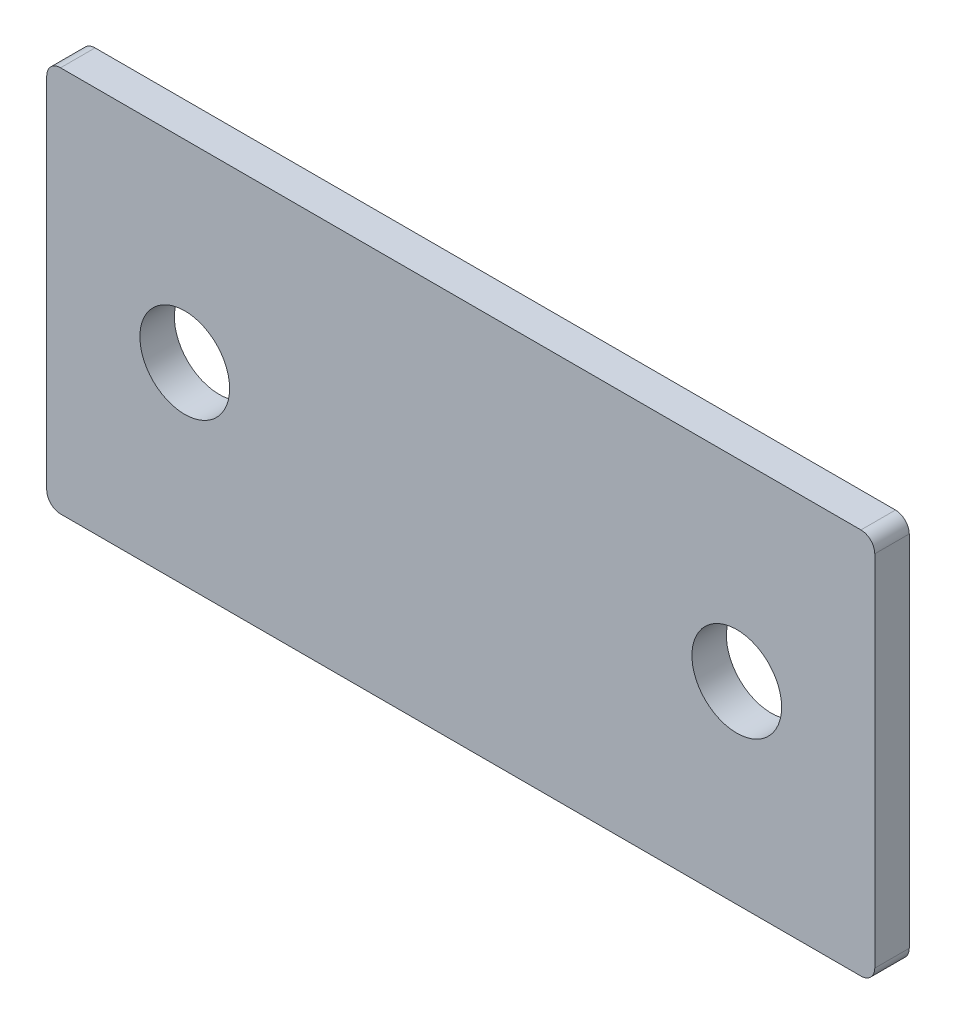
ISO-10303-21;
HEADER;
FILE_DESCRIPTION(('STEP AP214'),'2;1');
FILE_NAME('part.step','',(''),(''),'','','');
FILE_SCHEMA(('AUTOMOTIVE_DESIGN { 1 0 10303 214 1 1 1 1 }'));
ENDSEC;
DATA;
#1=APPLICATION_CONTEXT('core data for automotive mechanical design processes');
#2=APPLICATION_PROTOCOL_DEFINITION('international standard','automotive_design',2000,#1);
#3=PRODUCT_CONTEXT('',#1,'mechanical');
#4=PRODUCT('Part','Part','',(#3));
#5=PRODUCT_RELATED_PRODUCT_CATEGORY('part','',(#4));
#6=PRODUCT_DEFINITION_FORMATION('','',#4);
#7=PRODUCT_DEFINITION_CONTEXT('part definition',#1,'design');
#8=PRODUCT_DEFINITION('design','',#6,#7);
#9=PRODUCT_DEFINITION_SHAPE('','',#8);
#10=(LENGTH_UNIT() NAMED_UNIT(*) SI_UNIT(.MILLI.,.METRE.));
#11=(NAMED_UNIT(*) PLANE_ANGLE_UNIT() SI_UNIT($,.RADIAN.));
#12=(NAMED_UNIT(*) SI_UNIT($,.STERADIAN.) SOLID_ANGLE_UNIT());
#13=UNCERTAINTY_MEASURE_WITH_UNIT(LENGTH_MEASURE(1.E-05),#10,'distance_accuracy_value','');
#14=(GEOMETRIC_REPRESENTATION_CONTEXT(3) GLOBAL_UNCERTAINTY_ASSIGNED_CONTEXT((#13)) GLOBAL_UNIT_ASSIGNED_CONTEXT((#10,
#11,#12)) REPRESENTATION_CONTEXT('',''));
#15=CARTESIAN_POINT('',(0.,0.,0.));
#16=DIRECTION('',(0.,0.,1.));
#17=DIRECTION('',(1.,0.,0.));
#18=AXIS2_PLACEMENT_3D('',#15,#16,#17);
#19=CARTESIAN_POINT('',(0.,0.,2.5));
#20=DIRECTION('',(0.,0.,-1.));
#21=DIRECTION('',(-1.,0.,0.));
#22=AXIS2_PLACEMENT_3D('',#19,#20,#21);
#23=PLANE('',#22);
#24=DIRECTION('',(0.,-1.,0.));
#25=VECTOR('',#24,1.);
#26=CARTESIAN_POINT('',(-30.,-14.,2.5));
#27=LINE('',#26,#25);
#28=CARTESIAN_POINT('',(-30.,13.,2.5));
#29=VERTEX_POINT('',#28);
#30=CARTESIAN_POINT('',(-30.,-13.,2.5));
#31=VERTEX_POINT('',#30);
#32=EDGE_CURVE('E173',#29,#31,#27,.T.);
#33=ORIENTED_EDGE('',*,*,#32,.T.);
#34=CARTESIAN_POINT('',(-29.,-13.,2.5));
#35=DIRECTION('',(0.,0.,-1.));
#36=DIRECTION('',(-1.,0.,0.));
#37=AXIS2_PLACEMENT_3D('',#34,#35,#36);
#38=CIRCLE('',#37,1.);
#39=CARTESIAN_POINT('',(-29.,-14.,2.5));
#40=VERTEX_POINT('',#39);
#41=EDGE_CURVE('E150',#31,#40,#38,.F.);
#42=ORIENTED_EDGE('',*,*,#41,.T.);
#43=DIRECTION('',(1.,0.,0.));
#44=VECTOR('',#43,1.);
#45=CARTESIAN_POINT('',(-30.,-14.,2.5));
#46=LINE('',#45,#44);
#47=CARTESIAN_POINT('',(29.,-14.,2.5));
#48=VERTEX_POINT('',#47);
#49=EDGE_CURVE('E121',#40,#48,#46,.T.);
#50=ORIENTED_EDGE('',*,*,#49,.T.);
#51=CARTESIAN_POINT('',(29.,-13.,2.5));
#52=DIRECTION('',(0.,0.,-1.));
#53=DIRECTION('',(-1.,0.,0.));
#54=AXIS2_PLACEMENT_3D('',#51,#52,#53);
#55=CIRCLE('',#54,1.);
#56=CARTESIAN_POINT('',(30.,-13.,2.5));
#57=VERTEX_POINT('',#56);
#58=EDGE_CURVE('E146',#48,#57,#55,.F.);
#59=ORIENTED_EDGE('',*,*,#58,.T.);
#60=DIRECTION('',(0.,1.,0.));
#61=VECTOR('',#60,1.);
#62=CARTESIAN_POINT('',(30.,-14.,2.5));
#63=LINE('',#62,#61);
#64=CARTESIAN_POINT('',(30.,13.,2.5));
#65=VERTEX_POINT('',#64);
#66=EDGE_CURVE('E129',#57,#65,#63,.T.);
#67=ORIENTED_EDGE('',*,*,#66,.T.);
#68=CARTESIAN_POINT('',(29.,13.,2.5));
#69=DIRECTION('',(0.,0.,-1.));
#70=DIRECTION('',(-1.,0.,0.));
#71=AXIS2_PLACEMENT_3D('',#68,#69,#70);
#72=CIRCLE('',#71,1.);
#73=CARTESIAN_POINT('',(29.,14.,2.5));
#74=VERTEX_POINT('',#73);
#75=EDGE_CURVE('E56',#65,#74,#72,.F.);
#76=ORIENTED_EDGE('',*,*,#75,.T.);
#77=DIRECTION('',(-1.,0.,0.));
#78=VECTOR('',#77,1.);
#79=CARTESIAN_POINT('',(-30.,14.,2.5));
#80=LINE('',#79,#78);
#81=CARTESIAN_POINT('',(-29.,14.,2.5));
#82=VERTEX_POINT('',#81);
#83=EDGE_CURVE('E132',#74,#82,#80,.T.);
#84=ORIENTED_EDGE('',*,*,#83,.T.);
#85=CARTESIAN_POINT('',(-29.,13.,2.5));
#86=DIRECTION('',(0.,0.,-1.));
#87=DIRECTION('',(-1.,0.,0.));
#88=AXIS2_PLACEMENT_3D('',#85,#86,#87);
#89=CIRCLE('',#88,1.);
#90=EDGE_CURVE('E148',#82,#29,#89,.F.);
#91=ORIENTED_EDGE('',*,*,#90,.T.);
#92=EDGE_LOOP('',(#33,#42,#50,#59,#67,#76,#84,#91));
#93=FACE_BOUND('',#92,.T.);
#94=CARTESIAN_POINT('',(-20.,0.,2.5));
#95=DIRECTION('',(0.,0.,1.));
#96=DIRECTION('',(1.,0.,0.));
#97=AXIS2_PLACEMENT_3D('',#94,#95,#96);
#98=CIRCLE('',#97,3.25);
#99=CARTESIAN_POINT('',(-16.75,0.,2.5));
#100=VERTEX_POINT('',#99);
#101=EDGE_CURVE('E169',#100,#100,#98,.T.);
#102=ORIENTED_EDGE('',*,*,#101,.F.);
#103=EDGE_LOOP('',(#102));
#104=FACE_BOUND('',#103,.T.);
#105=CARTESIAN_POINT('',(20.,0.,2.5));
#106=DIRECTION('',(0.,0.,1.));
#107=DIRECTION('',(1.,0.,0.));
#108=AXIS2_PLACEMENT_3D('',#105,#106,#107);
#109=CIRCLE('',#108,3.25);
#110=CARTESIAN_POINT('',(23.25,0.,2.5));
#111=VERTEX_POINT('',#110);
#112=EDGE_CURVE('E179',#111,#111,#109,.T.);
#113=ORIENTED_EDGE('',*,*,#112,.F.);
#114=EDGE_LOOP('',(#113));
#115=FACE_BOUND('',#114,.T.);
#116=ADVANCED_FACE('F34',(#93,#104,#115),#23,.F.);
#117=CARTESIAN_POINT('',(0.,0.,0.));
#118=DIRECTION('',(0.,0.,-1.));
#119=DIRECTION('',(-1.,0.,0.));
#120=AXIS2_PLACEMENT_3D('',#117,#118,#119);
#121=PLANE('',#120);
#122=CARTESIAN_POINT('',(-20.,0.,0.));
#123=DIRECTION('',(0.,0.,1.));
#124=DIRECTION('',(1.,0.,0.));
#125=AXIS2_PLACEMENT_3D('',#122,#123,#124);
#126=CIRCLE('',#125,3.25);
#127=CARTESIAN_POINT('',(-16.75,0.,0.));
#128=VERTEX_POINT('',#127);
#129=EDGE_CURVE('E176',#128,#128,#126,.T.);
#130=ORIENTED_EDGE('',*,*,#129,.T.);
#131=EDGE_LOOP('',(#130));
#132=FACE_BOUND('',#131,.T.);
#133=DIRECTION('',(1.,0.,0.));
#134=VECTOR('',#133,1.);
#135=CARTESIAN_POINT('',(-30.,-14.,0.));
#136=LINE('',#135,#134);
#137=CARTESIAN_POINT('',(-29.,-14.,0.));
#138=VERTEX_POINT('',#137);
#139=CARTESIAN_POINT('',(29.,-14.,0.));
#140=VERTEX_POINT('',#139);
#141=EDGE_CURVE('E118',#138,#140,#136,.T.);
#142=ORIENTED_EDGE('',*,*,#141,.F.);
#143=CARTESIAN_POINT('',(-29.,-13.,0.));
#144=DIRECTION('',(0.,0.,-1.));
#145=DIRECTION('',(-1.,0.,0.));
#146=AXIS2_PLACEMENT_3D('',#143,#144,#145);
#147=CIRCLE('',#146,1.);
#148=CARTESIAN_POINT('',(-30.,-13.,0.));
#149=VERTEX_POINT('',#148);
#150=EDGE_CURVE('E101',#138,#149,#147,.T.);
#151=ORIENTED_EDGE('',*,*,#150,.T.);
#152=DIRECTION('',(0.,-1.,0.));
#153=VECTOR('',#152,1.);
#154=CARTESIAN_POINT('',(-30.,-14.,0.));
#155=LINE('',#154,#153);
#156=CARTESIAN_POINT('',(-30.,13.,0.));
#157=VERTEX_POINT('',#156);
#158=EDGE_CURVE('E130',#157,#149,#155,.T.);
#159=ORIENTED_EDGE('',*,*,#158,.F.);
#160=CARTESIAN_POINT('',(-29.,13.,0.));
#161=DIRECTION('',(0.,0.,-1.));
#162=DIRECTION('',(-1.,0.,0.));
#163=AXIS2_PLACEMENT_3D('',#160,#161,#162);
#164=CIRCLE('',#163,1.);
#165=CARTESIAN_POINT('',(-29.,14.,0.));
#166=VERTEX_POINT('',#165);
#167=EDGE_CURVE('E112',#157,#166,#164,.T.);
#168=ORIENTED_EDGE('',*,*,#167,.T.);
#169=DIRECTION('',(-1.,0.,0.));
#170=VECTOR('',#169,1.);
#171=CARTESIAN_POINT('',(-30.,14.,0.));
#172=LINE('',#171,#170);
#173=CARTESIAN_POINT('',(29.,14.,0.));
#174=VERTEX_POINT('',#173);
#175=EDGE_CURVE('E134',#174,#166,#172,.T.);
#176=ORIENTED_EDGE('',*,*,#175,.F.);
#177=CARTESIAN_POINT('',(29.,13.,0.));
#178=DIRECTION('',(0.,0.,-1.));
#179=DIRECTION('',(-1.,0.,0.));
#180=AXIS2_PLACEMENT_3D('',#177,#178,#179);
#181=CIRCLE('',#180,1.);
#182=CARTESIAN_POINT('',(30.,13.,0.));
#183=VERTEX_POINT('',#182);
#184=EDGE_CURVE('E122',#174,#183,#181,.T.);
#185=ORIENTED_EDGE('',*,*,#184,.T.);
#186=DIRECTION('',(0.,1.,0.));
#187=VECTOR('',#186,1.);
#188=CARTESIAN_POINT('',(30.,-14.,0.));
#189=LINE('',#188,#187);
#190=CARTESIAN_POINT('',(30.,-13.,0.));
#191=VERTEX_POINT('',#190);
#192=EDGE_CURVE('E161',#191,#183,#189,.T.);
#193=ORIENTED_EDGE('',*,*,#192,.F.);
#194=CARTESIAN_POINT('',(29.,-13.,0.));
#195=DIRECTION('',(0.,0.,-1.));
#196=DIRECTION('',(-1.,0.,0.));
#197=AXIS2_PLACEMENT_3D('',#194,#195,#196);
#198=CIRCLE('',#197,1.);
#199=EDGE_CURVE('E128',#191,#140,#198,.T.);
#200=ORIENTED_EDGE('',*,*,#199,.T.);
#201=EDGE_LOOP('',(#142,#151,#159,#168,#176,#185,#193,#200));
#202=FACE_BOUND('',#201,.T.);
#203=CARTESIAN_POINT('',(20.,0.,0.));
#204=DIRECTION('',(0.,0.,1.));
#205=DIRECTION('',(1.,0.,0.));
#206=AXIS2_PLACEMENT_3D('',#203,#204,#205);
#207=CIRCLE('',#206,3.25);
#208=CARTESIAN_POINT('',(23.25,0.,0.));
#209=VERTEX_POINT('',#208);
#210=EDGE_CURVE('E182',#209,#209,#207,.T.);
#211=ORIENTED_EDGE('',*,*,#210,.T.);
#212=EDGE_LOOP('',(#211));
#213=FACE_BOUND('',#212,.T.);
#214=ADVANCED_FACE('F125',(#132,#202,#213),#121,.T.);
#215=CARTESIAN_POINT('',(30.,-14.,2.5));
#216=DIRECTION('',(-1.,0.,0.));
#217=DIRECTION('',(0.,0.,1.));
#218=AXIS2_PLACEMENT_3D('',#215,#216,#217);
#219=PLANE('',#218);
#220=ORIENTED_EDGE('',*,*,#66,.F.);
#221=DIRECTION('',(0.,0.,-1.));
#222=VECTOR('',#221,1.);
#223=CARTESIAN_POINT('',(30.,-13.,2.5));
#224=LINE('',#223,#222);
#225=EDGE_CURVE('E11',#57,#191,#224,.T.);
#226=ORIENTED_EDGE('',*,*,#225,.T.);
#227=ORIENTED_EDGE('',*,*,#192,.T.);
#228=DIRECTION('',(0.,0.,-1.));
#229=VECTOR('',#228,1.);
#230=CARTESIAN_POINT('',(30.,13.,2.5));
#231=LINE('',#230,#229);
#232=EDGE_CURVE('E42',#183,#65,#231,.F.);
#233=ORIENTED_EDGE('',*,*,#232,.T.);
#234=EDGE_LOOP('',(#220,#226,#227,#233));
#235=FACE_BOUND('',#234,.T.);
#236=ADVANCED_FACE('F159',(#235),#219,.F.);
#237=CARTESIAN_POINT('',(-30.,14.,2.5));
#238=DIRECTION('',(0.,-1.,0.));
#239=DIRECTION('',(0.,0.,-1.));
#240=AXIS2_PLACEMENT_3D('',#237,#238,#239);
#241=PLANE('',#240);
#242=ORIENTED_EDGE('',*,*,#175,.T.);
#243=DIRECTION('',(0.,0.,-1.));
#244=VECTOR('',#243,1.);
#245=CARTESIAN_POINT('',(-29.,14.,2.5));
#246=LINE('',#245,#244);
#247=EDGE_CURVE('E49',#166,#82,#246,.F.);
#248=ORIENTED_EDGE('',*,*,#247,.T.);
#249=ORIENTED_EDGE('',*,*,#83,.F.);
#250=DIRECTION('',(0.,0.,-1.));
#251=VECTOR('',#250,1.);
#252=CARTESIAN_POINT('',(29.,14.,2.5));
#253=LINE('',#252,#251);
#254=EDGE_CURVE('E152',#74,#174,#253,.T.);
#255=ORIENTED_EDGE('',*,*,#254,.T.);
#256=EDGE_LOOP('',(#242,#248,#249,#255));
#257=FACE_BOUND('',#256,.T.);
#258=ADVANCED_FACE('F168',(#257),#241,.F.);
#259=CARTESIAN_POINT('',(-30.,-14.,2.5));
#260=DIRECTION('',(1.,0.,0.));
#261=DIRECTION('',(0.,0.,-1.));
#262=AXIS2_PLACEMENT_3D('',#259,#260,#261);
#263=PLANE('',#262);
#264=ORIENTED_EDGE('',*,*,#158,.T.);
#265=DIRECTION('',(0.,0.,-1.));
#266=VECTOR('',#265,1.);
#267=CARTESIAN_POINT('',(-30.,-13.,2.5));
#268=LINE('',#267,#266);
#269=EDGE_CURVE('E106',#149,#31,#268,.F.);
#270=ORIENTED_EDGE('',*,*,#269,.T.);
#271=ORIENTED_EDGE('',*,*,#32,.F.);
#272=DIRECTION('',(0.,0.,-1.));
#273=VECTOR('',#272,1.);
#274=CARTESIAN_POINT('',(-30.,13.,2.5));
#275=LINE('',#274,#273);
#276=EDGE_CURVE('E111',#29,#157,#275,.T.);
#277=ORIENTED_EDGE('',*,*,#276,.T.);
#278=EDGE_LOOP('',(#264,#270,#271,#277));
#279=FACE_BOUND('',#278,.T.);
#280=ADVANCED_FACE('F204',(#279),#263,.F.);
#281=CARTESIAN_POINT('',(-30.,-14.,2.5));
#282=DIRECTION('',(0.,1.,0.));
#283=DIRECTION('',(0.,0.,1.));
#284=AXIS2_PLACEMENT_3D('',#281,#282,#283);
#285=PLANE('',#284);
#286=ORIENTED_EDGE('',*,*,#49,.F.);
#287=DIRECTION('',(0.,0.,-1.));
#288=VECTOR('',#287,1.);
#289=CARTESIAN_POINT('',(-29.,-14.,2.5));
#290=LINE('',#289,#288);
#291=EDGE_CURVE('E105',#40,#138,#290,.T.);
#292=ORIENTED_EDGE('',*,*,#291,.T.);
#293=ORIENTED_EDGE('',*,*,#141,.T.);
#294=DIRECTION('',(0.,0.,-1.));
#295=VECTOR('',#294,1.);
#296=CARTESIAN_POINT('',(29.,-14.,2.5));
#297=LINE('',#296,#295);
#298=EDGE_CURVE('E123',#140,#48,#297,.F.);
#299=ORIENTED_EDGE('',*,*,#298,.T.);
#300=EDGE_LOOP('',(#286,#292,#293,#299));
#301=FACE_BOUND('',#300,.T.);
#302=ADVANCED_FACE('F117',(#301),#285,.F.);
#303=CARTESIAN_POINT('',(-20.,0.,2.5));
#304=DIRECTION('',(0.,0.,-1.));
#305=DIRECTION('',(-1.,0.,0.));
#306=AXIS2_PLACEMENT_3D('',#303,#304,#305);
#307=CYLINDRICAL_SURFACE('',#306,3.25);
#308=ORIENTED_EDGE('',*,*,#101,.T.);
#309=EDGE_LOOP('',(#308));
#310=FACE_BOUND('',#309,.T.);
#311=ORIENTED_EDGE('',*,*,#129,.F.);
#312=EDGE_LOOP('',(#311));
#313=FACE_BOUND('',#312,.T.);
#314=ADVANCED_FACE('F199',(#310,#313),#307,.F.);
#315=CARTESIAN_POINT('',(20.,0.,2.5));
#316=DIRECTION('',(0.,0.,-1.));
#317=DIRECTION('',(-1.,0.,0.));
#318=AXIS2_PLACEMENT_3D('',#315,#316,#317);
#319=CYLINDRICAL_SURFACE('',#318,3.25);
#320=ORIENTED_EDGE('',*,*,#112,.T.);
#321=EDGE_LOOP('',(#320));
#322=FACE_BOUND('',#321,.T.);
#323=ORIENTED_EDGE('',*,*,#210,.F.);
#324=EDGE_LOOP('',(#323));
#325=FACE_BOUND('',#324,.T.);
#326=ADVANCED_FACE('F188',(#322,#325),#319,.F.);
#327=CARTESIAN_POINT('',(-29.,-13.,2.5));
#328=DIRECTION('',(0.,0.,-1.));
#329=DIRECTION('',(-1.,0.,0.));
#330=AXIS2_PLACEMENT_3D('',#327,#328,#329);
#331=CYLINDRICAL_SURFACE('',#330,1.);
#332=ORIENTED_EDGE('',*,*,#41,.F.);
#333=ORIENTED_EDGE('',*,*,#269,.F.);
#334=ORIENTED_EDGE('',*,*,#150,.F.);
#335=ORIENTED_EDGE('',*,*,#291,.F.);
#336=EDGE_LOOP('',(#332,#333,#334,#335));
#337=FACE_BOUND('',#336,.T.);
#338=ADVANCED_FACE('F104',(#337),#331,.T.);
#339=CARTESIAN_POINT('',(-29.,13.,2.5));
#340=DIRECTION('',(0.,0.,-1.));
#341=DIRECTION('',(-1.,0.,0.));
#342=AXIS2_PLACEMENT_3D('',#339,#340,#341);
#343=CYLINDRICAL_SURFACE('',#342,1.);
#344=ORIENTED_EDGE('',*,*,#90,.F.);
#345=ORIENTED_EDGE('',*,*,#247,.F.);
#346=ORIENTED_EDGE('',*,*,#167,.F.);
#347=ORIENTED_EDGE('',*,*,#276,.F.);
#348=EDGE_LOOP('',(#344,#345,#346,#347));
#349=FACE_BOUND('',#348,.T.);
#350=ADVANCED_FACE('F214',(#349),#343,.T.);
#351=CARTESIAN_POINT('',(29.,-13.,2.5));
#352=DIRECTION('',(0.,0.,-1.));
#353=DIRECTION('',(-1.,0.,0.));
#354=AXIS2_PLACEMENT_3D('',#351,#352,#353);
#355=CYLINDRICAL_SURFACE('',#354,1.);
#356=ORIENTED_EDGE('',*,*,#58,.F.);
#357=ORIENTED_EDGE('',*,*,#298,.F.);
#358=ORIENTED_EDGE('',*,*,#199,.F.);
#359=ORIENTED_EDGE('',*,*,#225,.F.);
#360=EDGE_LOOP('',(#356,#357,#358,#359));
#361=FACE_BOUND('',#360,.T.);
#362=ADVANCED_FACE('F216',(#361),#355,.T.);
#363=CARTESIAN_POINT('',(29.,13.,2.5));
#364=DIRECTION('',(0.,0.,-1.));
#365=DIRECTION('',(-1.,0.,0.));
#366=AXIS2_PLACEMENT_3D('',#363,#364,#365);
#367=CYLINDRICAL_SURFACE('',#366,1.);
#368=ORIENTED_EDGE('',*,*,#75,.F.);
#369=ORIENTED_EDGE('',*,*,#232,.F.);
#370=ORIENTED_EDGE('',*,*,#184,.F.);
#371=ORIENTED_EDGE('',*,*,#254,.F.);
#372=EDGE_LOOP('',(#368,#369,#370,#371));
#373=FACE_BOUND('',#372,.T.);
#374=ADVANCED_FACE('F36',(#373),#367,.T.);
#375=CLOSED_SHELL('',(#116,#214,#236,#258,#280,#302,#314,#326,#338,#350,#362,#374));
#376=MANIFOLD_SOLID_BREP('B2',#375);
#377=ADVANCED_BREP_SHAPE_REPRESENTATION('',(#18,#376),#14);
#378=SHAPE_DEFINITION_REPRESENTATION(#9,#377);
ENDSEC;
END-ISO-10303-21;
